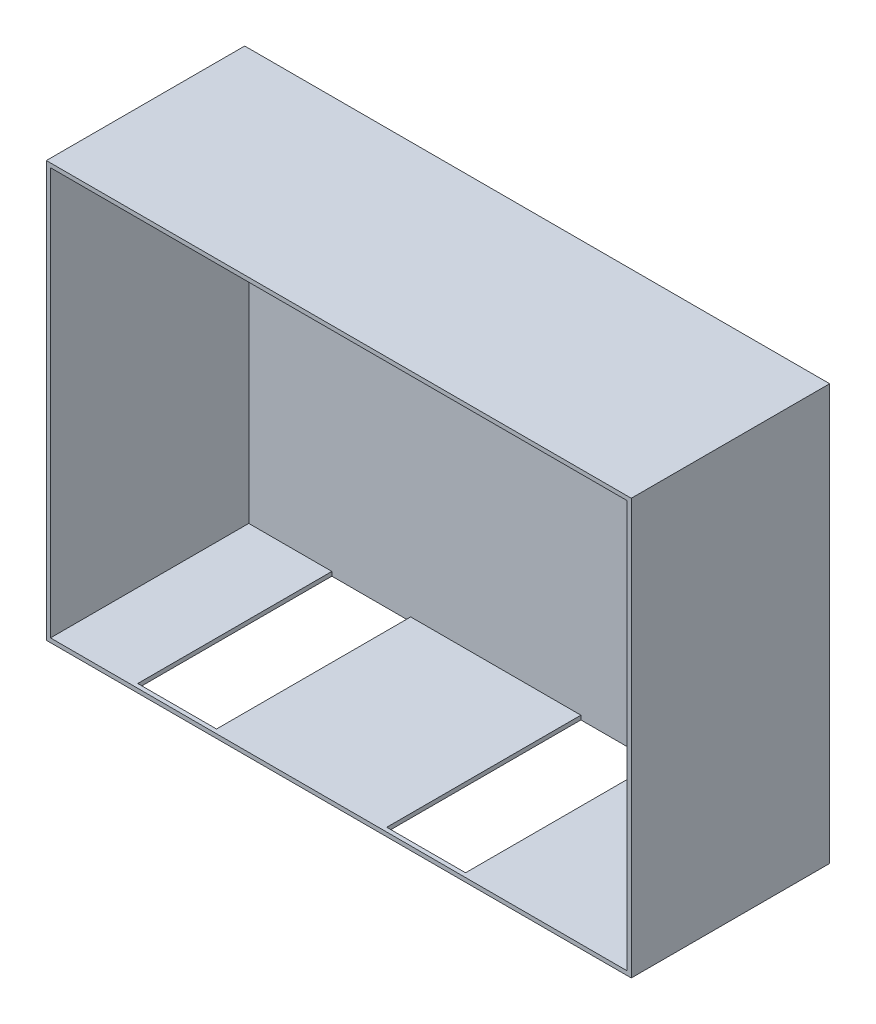
ISO-10303-21;
HEADER;
FILE_DESCRIPTION(('STEP AP214'),'2;1');
FILE_NAME('part.step','',(''),(''),'','','');
FILE_SCHEMA(('AUTOMOTIVE_DESIGN { 1 0 10303 214 1 1 1 1 }'));
ENDSEC;
DATA;
#1=APPLICATION_CONTEXT('core data for automotive mechanical design processes');
#2=APPLICATION_PROTOCOL_DEFINITION('international standard','automotive_design',2000,#1);
#3=PRODUCT_CONTEXT('',#1,'mechanical');
#4=PRODUCT('Part','Part','',(#3));
#5=PRODUCT_RELATED_PRODUCT_CATEGORY('part','',(#4));
#6=PRODUCT_DEFINITION_FORMATION('','',#4);
#7=PRODUCT_DEFINITION_CONTEXT('part definition',#1,'design');
#8=PRODUCT_DEFINITION('design','',#6,#7);
#9=PRODUCT_DEFINITION_SHAPE('','',#8);
#10=(LENGTH_UNIT() NAMED_UNIT(*) SI_UNIT(.MILLI.,.METRE.));
#11=(NAMED_UNIT(*) PLANE_ANGLE_UNIT() SI_UNIT($,.RADIAN.));
#12=(NAMED_UNIT(*) SI_UNIT($,.STERADIAN.) SOLID_ANGLE_UNIT());
#13=UNCERTAINTY_MEASURE_WITH_UNIT(LENGTH_MEASURE(1.E-05),#10,'distance_accuracy_value','');
#14=(GEOMETRIC_REPRESENTATION_CONTEXT(3) GLOBAL_UNCERTAINTY_ASSIGNED_CONTEXT((#13)) GLOBAL_UNIT_ASSIGNED_CONTEXT((#10,
#11,#12)) REPRESENTATION_CONTEXT('',''));
#15=CARTESIAN_POINT('',(0.,0.,0.));
#16=DIRECTION('',(0.,0.,1.));
#17=DIRECTION('',(1.,0.,0.));
#18=AXIS2_PLACEMENT_3D('',#15,#16,#17);
#19=CARTESIAN_POINT('',(0.,0.,2400.));
#20=DIRECTION('',(0.,0.,-1.));
#21=DIRECTION('',(-1.,0.,0.));
#22=AXIS2_PLACEMENT_3D('',#19,#20,#21);
#23=PLANE('',#22);
#24=DIRECTION('',(-1.,0.,0.));
#25=VECTOR('',#24,1.);
#26=CARTESIAN_POINT('',(-3540.,2514.5,2400.));
#27=LINE('',#26,#25);
#28=CARTESIAN_POINT('',(3540.,2514.5,2400.));
#29=VERTEX_POINT('',#28);
#30=CARTESIAN_POINT('',(-3540.,2514.5,2400.));
#31=VERTEX_POINT('',#30);
#32=EDGE_CURVE('E271',#29,#31,#27,.T.);
#33=ORIENTED_EDGE('',*,*,#32,.T.);
#34=DIRECTION('',(0.,-1.,0.));
#35=VECTOR('',#34,1.);
#36=CARTESIAN_POINT('',(-3540.,2514.5,2400.));
#37=LINE('',#36,#35);
#38=CARTESIAN_POINT('',(-3540.,-2514.5,2400.));
#39=VERTEX_POINT('',#38);
#40=EDGE_CURVE('E274',#31,#39,#37,.T.);
#41=ORIENTED_EDGE('',*,*,#40,.T.);
#42=DIRECTION('',(1.,0.,0.));
#43=VECTOR('',#42,1.);
#44=CARTESIAN_POINT('',(-3540.,-2514.5,2400.));
#45=LINE('',#44,#43);
#46=CARTESIAN_POINT('',(3540.,-2514.5,2400.));
#47=VERTEX_POINT('',#46);
#48=EDGE_CURVE('E276',#39,#47,#45,.T.);
#49=ORIENTED_EDGE('',*,*,#48,.T.);
#50=DIRECTION('',(0.,1.,0.));
#51=VECTOR('',#50,1.);
#52=CARTESIAN_POINT('',(3540.,2514.5,2400.));
#53=LINE('',#52,#51);
#54=EDGE_CURVE('E157',#47,#29,#53,.T.);
#55=ORIENTED_EDGE('',*,*,#54,.T.);
#56=EDGE_LOOP('',(#33,#41,#49,#55));
#57=FACE_BOUND('',#56,.T.);
#58=DIRECTION('',(0.,1.,0.));
#59=VECTOR('',#58,1.);
#60=CARTESIAN_POINT('',(3490.,2464.5,2400.));
#61=LINE('',#60,#59);
#62=CARTESIAN_POINT('',(3490.,-2464.5,2400.));
#63=VERTEX_POINT('',#62);
#64=CARTESIAN_POINT('',(3490.,2464.5,2400.));
#65=VERTEX_POINT('',#64);
#66=EDGE_CURVE('E239',#63,#65,#61,.T.);
#67=ORIENTED_EDGE('',*,*,#66,.F.);
#68=DIRECTION('',(1.,0.,0.));
#69=VECTOR('',#68,1.);
#70=CARTESIAN_POINT('',(-3490.,-2464.5,2400.));
#71=LINE('',#70,#69);
#72=CARTESIAN_POINT('',(-3490.,-2464.5,2400.));
#73=VERTEX_POINT('',#72);
#74=EDGE_CURVE('E247',#73,#63,#71,.T.);
#75=ORIENTED_EDGE('',*,*,#74,.F.);
#76=DIRECTION('',(0.,-1.,0.));
#77=VECTOR('',#76,1.);
#78=CARTESIAN_POINT('',(-3490.,2464.5,2400.));
#79=LINE('',#78,#77);
#80=CARTESIAN_POINT('',(-3490.,2464.5,2400.));
#81=VERTEX_POINT('',#80);
#82=EDGE_CURVE('E244',#81,#73,#79,.T.);
#83=ORIENTED_EDGE('',*,*,#82,.F.);
#84=DIRECTION('',(-1.,0.,0.));
#85=VECTOR('',#84,1.);
#86=CARTESIAN_POINT('',(-3490.,2464.5,2400.));
#87=LINE('',#86,#85);
#88=EDGE_CURVE('E241',#65,#81,#87,.T.);
#89=ORIENTED_EDGE('',*,*,#88,.F.);
#90=EDGE_LOOP('',(#67,#75,#83,#89));
#91=FACE_BOUND('',#90,.T.);
#92=ADVANCED_FACE('F37',(#57,#91),#23,.F.);
#93=CARTESIAN_POINT('',(-3540.,2514.5,2400.));
#94=DIRECTION('',(0.,-1.,0.));
#95=DIRECTION('',(0.,0.,-1.));
#96=AXIS2_PLACEMENT_3D('',#93,#94,#95);
#97=PLANE('',#96);
#98=DIRECTION('',(0.,0.,-1.));
#99=VECTOR('',#98,1.);
#100=CARTESIAN_POINT('',(3540.,2514.5,2400.));
#101=LINE('',#100,#99);
#102=CARTESIAN_POINT('',(3540.,2514.5,-1.));
#103=VERTEX_POINT('',#102);
#104=EDGE_CURVE('E160',#29,#103,#101,.T.);
#105=ORIENTED_EDGE('',*,*,#104,.T.);
#106=DIRECTION('',(1.,0.,0.));
#107=VECTOR('',#106,1.);
#108=CARTESIAN_POINT('',(3540.,2514.5,-1.));
#109=LINE('',#108,#107);
#110=CARTESIAN_POINT('',(-3540.,2514.5,-1.));
#111=VERTEX_POINT('',#110);
#112=EDGE_CURVE('E175',#111,#103,#109,.T.);
#113=ORIENTED_EDGE('',*,*,#112,.F.);
#114=DIRECTION('',(0.,0.,-1.));
#115=VECTOR('',#114,1.);
#116=CARTESIAN_POINT('',(-3540.,2514.5,2400.));
#117=LINE('',#116,#115);
#118=EDGE_CURVE('E11',#31,#111,#117,.T.);
#119=ORIENTED_EDGE('',*,*,#118,.F.);
#120=ORIENTED_EDGE('',*,*,#32,.F.);
#121=EDGE_LOOP('',(#105,#113,#119,#120));
#122=FACE_BOUND('',#121,.T.);
#123=ADVANCED_FACE('F39',(#122),#97,.F.);
#124=CARTESIAN_POINT('',(-3540.,2514.5,2400.));
#125=DIRECTION('',(1.,0.,0.));
#126=DIRECTION('',(0.,1.,0.));
#127=AXIS2_PLACEMENT_3D('',#124,#125,#126);
#128=PLANE('',#127);
#129=ORIENTED_EDGE('',*,*,#118,.T.);
#130=DIRECTION('',(0.,1.,0.));
#131=VECTOR('',#130,1.);
#132=CARTESIAN_POINT('',(-3540.,2514.5,-1.));
#133=LINE('',#132,#131);
#134=CARTESIAN_POINT('',(-3540.,-2514.5,-1.));
#135=VERTEX_POINT('',#134);
#136=EDGE_CURVE('E170',#135,#111,#133,.T.);
#137=ORIENTED_EDGE('',*,*,#136,.F.);
#138=DIRECTION('',(0.,0.,-1.));
#139=VECTOR('',#138,1.);
#140=CARTESIAN_POINT('',(-3540.,-2514.5,2400.));
#141=LINE('',#140,#139);
#142=EDGE_CURVE('E45',#39,#135,#141,.T.);
#143=ORIENTED_EDGE('',*,*,#142,.F.);
#144=ORIENTED_EDGE('',*,*,#40,.F.);
#145=EDGE_LOOP('',(#129,#137,#143,#144));
#146=FACE_BOUND('',#145,.T.);
#147=ADVANCED_FACE('F285',(#146),#128,.F.);
#148=CARTESIAN_POINT('',(-3540.,-2514.5,2400.));
#149=DIRECTION('',(0.,1.,0.));
#150=DIRECTION('',(-1.,0.,0.));
#151=AXIS2_PLACEMENT_3D('',#148,#149,#150);
#152=PLANE('',#151);
#153=DIRECTION('',(-1.,0.,0.));
#154=VECTOR('',#153,1.);
#155=CARTESIAN_POINT('',(3540.,-2514.5,-1.));
#156=LINE('',#155,#154);
#157=CARTESIAN_POINT('',(3540.,-2514.5,-1.));
#158=VERTEX_POINT('',#157);
#159=EDGE_CURVE('E163',#158,#135,#156,.T.);
#160=ORIENTED_EDGE('',*,*,#159,.F.);
#161=DIRECTION('',(0.,0.,-1.));
#162=VECTOR('',#161,1.);
#163=CARTESIAN_POINT('',(3540.,-2514.5,2400.));
#164=LINE('',#163,#162);
#165=EDGE_CURVE('E151',#47,#158,#164,.T.);
#166=ORIENTED_EDGE('',*,*,#165,.F.);
#167=ORIENTED_EDGE('',*,*,#48,.F.);
#168=ORIENTED_EDGE('',*,*,#142,.T.);
#169=EDGE_LOOP('',(#160,#166,#167,#168));
#170=FACE_BOUND('',#169,.T.);
#171=DIRECTION('',(-1.,0.,0.));
#172=VECTOR('',#171,1.);
#173=CARTESIAN_POINT('',(3540.,-2514.5,0.));
#174=LINE('',#173,#172);
#175=CARTESIAN_POINT('',(1484.,-2514.5,0.));
#176=VERTEX_POINT('',#175);
#177=CARTESIAN_POINT('',(530.000000000001,-2514.5,0.));
#178=VERTEX_POINT('',#177);
#179=EDGE_CURVE('E176',#176,#178,#174,.T.);
#180=ORIENTED_EDGE('',*,*,#179,.T.);
#181=DIRECTION('',(0.,0.,-1.));
#182=VECTOR('',#181,1.);
#183=CARTESIAN_POINT('',(530.000000000001,-2514.5,2350.));
#184=LINE('',#183,#182);
#185=CARTESIAN_POINT('',(530.000000000001,-2514.5,2350.));
#186=VERTEX_POINT('',#185);
#187=EDGE_CURVE('E221',#186,#178,#184,.T.);
#188=ORIENTED_EDGE('',*,*,#187,.F.);
#189=DIRECTION('',(-1.,0.,0.));
#190=VECTOR('',#189,1.);
#191=CARTESIAN_POINT('',(530.000000000001,-2514.5,2350.));
#192=LINE('',#191,#190);
#193=CARTESIAN_POINT('',(1484.,-2514.5,2350.));
#194=VERTEX_POINT('',#193);
#195=EDGE_CURVE('E229',#194,#186,#192,.T.);
#196=ORIENTED_EDGE('',*,*,#195,.F.);
#197=DIRECTION('',(0.,0.,1.));
#198=VECTOR('',#197,1.);
#199=CARTESIAN_POINT('',(1484.,-2514.5,2350.));
#200=LINE('',#199,#198);
#201=EDGE_CURVE('E232',#176,#194,#200,.T.);
#202=ORIENTED_EDGE('',*,*,#201,.F.);
#203=EDGE_LOOP('',(#180,#188,#196,#202));
#204=FACE_BOUND('',#203,.T.);
#205=DIRECTION('',(0.,0.,1.));
#206=VECTOR('',#205,1.);
#207=CARTESIAN_POINT('',(-1530.,-2514.5,2350.));
#208=LINE('',#207,#206);
#209=CARTESIAN_POINT('',(-1530.,-2514.5,0.));
#210=VERTEX_POINT('',#209);
#211=CARTESIAN_POINT('',(-1530.,-2514.5,2350.));
#212=VERTEX_POINT('',#211);
#213=EDGE_CURVE('E197',#210,#212,#208,.T.);
#214=ORIENTED_EDGE('',*,*,#213,.F.);
#215=CARTESIAN_POINT('',(-2484.,-2514.5,0.));
#216=VERTEX_POINT('',#215);
#217=EDGE_CURVE('E179',#210,#216,#174,.T.);
#218=ORIENTED_EDGE('',*,*,#217,.T.);
#219=DIRECTION('',(0.,0.,-1.));
#220=VECTOR('',#219,1.);
#221=CARTESIAN_POINT('',(-2484.,-2514.5,2350.));
#222=LINE('',#221,#220);
#223=CARTESIAN_POINT('',(-2484.,-2514.5,2350.));
#224=VERTEX_POINT('',#223);
#225=EDGE_CURVE('E202',#224,#216,#222,.T.);
#226=ORIENTED_EDGE('',*,*,#225,.F.);
#227=DIRECTION('',(-1.,0.,0.));
#228=VECTOR('',#227,1.);
#229=CARTESIAN_POINT('',(-2484.,-2514.5,2350.));
#230=LINE('',#229,#228);
#231=EDGE_CURVE('E199',#212,#224,#230,.T.);
#232=ORIENTED_EDGE('',*,*,#231,.F.);
#233=EDGE_LOOP('',(#214,#218,#226,#232));
#234=FACE_BOUND('',#233,.T.);
#235=ADVANCED_FACE('F164',(#170,#204,#234),#152,.F.);
#236=CARTESIAN_POINT('',(3540.,2514.5,2400.));
#237=DIRECTION('',(-1.,0.,0.));
#238=DIRECTION('',(0.,0.,1.));
#239=AXIS2_PLACEMENT_3D('',#236,#237,#238);
#240=PLANE('',#239);
#241=ORIENTED_EDGE('',*,*,#165,.T.);
#242=DIRECTION('',(0.,-1.,0.));
#243=VECTOR('',#242,1.);
#244=CARTESIAN_POINT('',(3540.,2514.5,-1.));
#245=LINE('',#244,#243);
#246=EDGE_CURVE('E156',#103,#158,#245,.T.);
#247=ORIENTED_EDGE('',*,*,#246,.F.);
#248=ORIENTED_EDGE('',*,*,#104,.F.);
#249=ORIENTED_EDGE('',*,*,#54,.F.);
#250=EDGE_LOOP('',(#241,#247,#248,#249));
#251=FACE_BOUND('',#250,.T.);
#252=ADVANCED_FACE('F153',(#251),#240,.F.);
#253=CARTESIAN_POINT('',(3490.,2464.5,2400.));
#254=DIRECTION('',(-1.,0.,0.));
#255=DIRECTION('',(0.,-1.,0.));
#256=AXIS2_PLACEMENT_3D('',#253,#254,#255);
#257=PLANE('',#256);
#258=DIRECTION('',(0.,1.,0.));
#259=VECTOR('',#258,1.);
#260=CARTESIAN_POINT('',(3490.,2464.5,0.));
#261=LINE('',#260,#259);
#262=CARTESIAN_POINT('',(3490.,-2464.5,0.));
#263=VERTEX_POINT('',#262);
#264=CARTESIAN_POINT('',(3490.,2464.5,0.));
#265=VERTEX_POINT('',#264);
#266=EDGE_CURVE('E216',#263,#265,#261,.T.);
#267=ORIENTED_EDGE('',*,*,#266,.F.);
#268=DIRECTION('',(0.,0.,-1.));
#269=VECTOR('',#268,1.);
#270=CARTESIAN_POINT('',(3490.,-2464.5,2400.));
#271=LINE('',#270,#269);
#272=EDGE_CURVE('E249',#63,#263,#271,.T.);
#273=ORIENTED_EDGE('',*,*,#272,.F.);
#274=ORIENTED_EDGE('',*,*,#66,.T.);
#275=DIRECTION('',(0.,0.,-1.));
#276=VECTOR('',#275,1.);
#277=CARTESIAN_POINT('',(3490.,2464.5,2400.));
#278=LINE('',#277,#276);
#279=EDGE_CURVE('E268',#65,#265,#278,.T.);
#280=ORIENTED_EDGE('',*,*,#279,.T.);
#281=EDGE_LOOP('',(#267,#273,#274,#280));
#282=FACE_BOUND('',#281,.T.);
#283=ADVANCED_FACE('F298',(#282),#257,.T.);
#284=CARTESIAN_POINT('',(-3490.,2464.5,2400.));
#285=DIRECTION('',(0.,-1.,0.));
#286=DIRECTION('',(0.,0.,-1.));
#287=AXIS2_PLACEMENT_3D('',#284,#285,#286);
#288=PLANE('',#287);
#289=DIRECTION('',(-1.,0.,0.));
#290=VECTOR('',#289,1.);
#291=CARTESIAN_POINT('',(-3490.,2464.5,0.));
#292=LINE('',#291,#290);
#293=CARTESIAN_POINT('',(-3490.,2464.5,0.));
#294=VERTEX_POINT('',#293);
#295=EDGE_CURVE('E252',#265,#294,#292,.T.);
#296=ORIENTED_EDGE('',*,*,#295,.F.);
#297=ORIENTED_EDGE('',*,*,#279,.F.);
#298=ORIENTED_EDGE('',*,*,#88,.T.);
#299=DIRECTION('',(0.,0.,-1.));
#300=VECTOR('',#299,1.);
#301=CARTESIAN_POINT('',(-3490.,2464.5,2400.));
#302=LINE('',#301,#300);
#303=EDGE_CURVE('E266',#81,#294,#302,.T.);
#304=ORIENTED_EDGE('',*,*,#303,.T.);
#305=EDGE_LOOP('',(#296,#297,#298,#304));
#306=FACE_BOUND('',#305,.T.);
#307=ADVANCED_FACE('F304',(#306),#288,.T.);
#308=CARTESIAN_POINT('',(-3490.,2464.5,2400.));
#309=DIRECTION('',(1.,0.,0.));
#310=DIRECTION('',(0.,1.,0.));
#311=AXIS2_PLACEMENT_3D('',#308,#309,#310);
#312=PLANE('',#311);
#313=DIRECTION('',(0.,-1.,0.));
#314=VECTOR('',#313,1.);
#315=CARTESIAN_POINT('',(-3490.,2464.5,0.));
#316=LINE('',#315,#314);
#317=CARTESIAN_POINT('',(-3490.,-2464.5,0.));
#318=VERTEX_POINT('',#317);
#319=EDGE_CURVE('E255',#294,#318,#316,.T.);
#320=ORIENTED_EDGE('',*,*,#319,.F.);
#321=ORIENTED_EDGE('',*,*,#303,.F.);
#322=ORIENTED_EDGE('',*,*,#82,.T.);
#323=DIRECTION('',(0.,0.,-1.));
#324=VECTOR('',#323,1.);
#325=CARTESIAN_POINT('',(-3490.,-2464.5,2400.));
#326=LINE('',#325,#324);
#327=EDGE_CURVE('E264',#73,#318,#326,.T.);
#328=ORIENTED_EDGE('',*,*,#327,.T.);
#329=EDGE_LOOP('',(#320,#321,#322,#328));
#330=FACE_BOUND('',#329,.T.);
#331=ADVANCED_FACE('F309',(#330),#312,.T.);
#332=CARTESIAN_POINT('',(-3490.,-2464.5,2400.));
#333=DIRECTION('',(0.,1.,0.));
#334=DIRECTION('',(0.,0.,1.));
#335=AXIS2_PLACEMENT_3D('',#332,#333,#334);
#336=PLANE('',#335);
#337=DIRECTION('',(0.,0.,-1.));
#338=VECTOR('',#337,1.);
#339=CARTESIAN_POINT('',(-2484.,-2464.5,2350.));
#340=LINE('',#339,#338);
#341=CARTESIAN_POINT('',(-2484.,-2464.5,2350.));
#342=VERTEX_POINT('',#341);
#343=CARTESIAN_POINT('',(-2484.,-2464.5,0.));
#344=VERTEX_POINT('',#343);
#345=EDGE_CURVE('E190',#342,#344,#340,.T.);
#346=ORIENTED_EDGE('',*,*,#345,.T.);
#347=DIRECTION('',(1.,0.,0.));
#348=VECTOR('',#347,1.);
#349=CARTESIAN_POINT('',(-3490.,-2464.5,0.));
#350=LINE('',#349,#348);
#351=EDGE_CURVE('E242',#318,#344,#350,.T.);
#352=ORIENTED_EDGE('',*,*,#351,.F.);
#353=ORIENTED_EDGE('',*,*,#327,.F.);
#354=ORIENTED_EDGE('',*,*,#74,.T.);
#355=ORIENTED_EDGE('',*,*,#272,.T.);
#356=CARTESIAN_POINT('',(1484.,-2464.5,0.));
#357=VERTEX_POINT('',#356);
#358=EDGE_CURVE('E258',#357,#263,#350,.T.);
#359=ORIENTED_EDGE('',*,*,#358,.F.);
#360=DIRECTION('',(0.,0.,1.));
#361=VECTOR('',#360,1.);
#362=CARTESIAN_POINT('',(1484.,-2464.5,2350.));
#363=LINE('',#362,#361);
#364=CARTESIAN_POINT('',(1484.,-2464.5,2350.));
#365=VERTEX_POINT('',#364);
#366=EDGE_CURVE('E234',#357,#365,#363,.T.);
#367=ORIENTED_EDGE('',*,*,#366,.T.);
#368=DIRECTION('',(-1.,0.,0.));
#369=VECTOR('',#368,1.);
#370=CARTESIAN_POINT('',(530.000000000001,-2464.5,2350.));
#371=LINE('',#370,#369);
#372=CARTESIAN_POINT('',(530.000000000001,-2464.5,2350.));
#373=VERTEX_POINT('',#372);
#374=EDGE_CURVE('E186',#365,#373,#371,.T.);
#375=ORIENTED_EDGE('',*,*,#374,.T.);
#376=DIRECTION('',(0.,0.,-1.));
#377=VECTOR('',#376,1.);
#378=CARTESIAN_POINT('',(530.000000000001,-2464.5,2350.));
#379=LINE('',#378,#377);
#380=CARTESIAN_POINT('',(530.,-2464.5,0.));
#381=VERTEX_POINT('',#380);
#382=EDGE_CURVE('E194',#373,#381,#379,.T.);
#383=ORIENTED_EDGE('',*,*,#382,.T.);
#384=CARTESIAN_POINT('',(-1530.,-2464.5,0.));
#385=VERTEX_POINT('',#384);
#386=EDGE_CURVE('E261',#385,#381,#350,.T.);
#387=ORIENTED_EDGE('',*,*,#386,.F.);
#388=DIRECTION('',(0.,0.,1.));
#389=VECTOR('',#388,1.);
#390=CARTESIAN_POINT('',(-1530.,-2464.5,2350.));
#391=LINE('',#390,#389);
#392=CARTESIAN_POINT('',(-1530.,-2464.5,2350.));
#393=VERTEX_POINT('',#392);
#394=EDGE_CURVE('E193',#385,#393,#391,.T.);
#395=ORIENTED_EDGE('',*,*,#394,.T.);
#396=DIRECTION('',(-1.,0.,0.));
#397=VECTOR('',#396,1.);
#398=CARTESIAN_POINT('',(-2484.,-2464.5,2350.));
#399=LINE('',#398,#397);
#400=EDGE_CURVE('E207',#393,#342,#399,.T.);
#401=ORIENTED_EDGE('',*,*,#400,.T.);
#402=EDGE_LOOP('',(#346,#352,#353,#354,#355,#359,#367,#375,#383,#387,#395,#401));
#403=FACE_BOUND('',#402,.T.);
#404=ADVANCED_FACE('F318',(#403),#336,.T.);
#405=CARTESIAN_POINT('',(530.000000000001,2514.501,2350.));
#406=DIRECTION('',(0.,0.,1.));
#407=DIRECTION('',(1.,0.,0.));
#408=AXIS2_PLACEMENT_3D('',#405,#406,#407);
#409=PLANE('',#408);
#410=DIRECTION('',(0.,-1.,0.));
#411=VECTOR('',#410,1.);
#412=CARTESIAN_POINT('',(1484.,2514.501,2350.));
#413=LINE('',#412,#411);
#414=EDGE_CURVE('E60',#365,#194,#413,.T.);
#415=ORIENTED_EDGE('',*,*,#414,.T.);
#416=ORIENTED_EDGE('',*,*,#195,.T.);
#417=DIRECTION('',(0.,-1.,0.));
#418=VECTOR('',#417,1.);
#419=CARTESIAN_POINT('',(530.000000000001,2514.501,2350.));
#420=LINE('',#419,#418);
#421=EDGE_CURVE('E222',#373,#186,#420,.T.);
#422=ORIENTED_EDGE('',*,*,#421,.F.);
#423=ORIENTED_EDGE('',*,*,#374,.F.);
#424=EDGE_LOOP('',(#415,#416,#422,#423));
#425=FACE_BOUND('',#424,.T.);
#426=ADVANCED_FACE('F330',(#425),#409,.F.);
#427=CARTESIAN_POINT('',(530.000000000001,2514.501,2350.));
#428=DIRECTION('',(-1.,0.,0.));
#429=DIRECTION('',(0.,0.,1.));
#430=AXIS2_PLACEMENT_3D('',#427,#428,#429);
#431=PLANE('',#430);
#432=ORIENTED_EDGE('',*,*,#421,.T.);
#433=ORIENTED_EDGE('',*,*,#187,.T.);
#434=DIRECTION('',(0.,-1.,0.));
#435=VECTOR('',#434,1.);
#436=CARTESIAN_POINT('',(530.000000000001,2514.501,0.));
#437=LINE('',#436,#435);
#438=EDGE_CURVE('E224',#381,#178,#437,.T.);
#439=ORIENTED_EDGE('',*,*,#438,.F.);
#440=ORIENTED_EDGE('',*,*,#382,.F.);
#441=EDGE_LOOP('',(#432,#433,#439,#440));
#442=FACE_BOUND('',#441,.T.);
#443=ADVANCED_FACE('F326',(#442),#431,.F.);
#444=CARTESIAN_POINT('',(1484.,2514.501,2350.));
#445=DIRECTION('',(1.,0.,0.));
#446=DIRECTION('',(0.,0.,-1.));
#447=AXIS2_PLACEMENT_3D('',#444,#445,#446);
#448=PLANE('',#447);
#449=DIRECTION('',(0.,-1.,0.));
#450=VECTOR('',#449,1.);
#451=CARTESIAN_POINT('',(1484.,2514.501,0.));
#452=LINE('',#451,#450);
#453=EDGE_CURVE('E219',#357,#176,#452,.T.);
#454=ORIENTED_EDGE('',*,*,#453,.T.);
#455=ORIENTED_EDGE('',*,*,#201,.T.);
#456=ORIENTED_EDGE('',*,*,#414,.F.);
#457=ORIENTED_EDGE('',*,*,#366,.F.);
#458=EDGE_LOOP('',(#454,#455,#456,#457));
#459=FACE_BOUND('',#458,.T.);
#460=ADVANCED_FACE('F334',(#459),#448,.F.);
#461=CARTESIAN_POINT('',(-2484.,2514.501,2350.));
#462=DIRECTION('',(0.,0.,1.));
#463=DIRECTION('',(1.,0.,0.));
#464=AXIS2_PLACEMENT_3D('',#461,#462,#463);
#465=PLANE('',#464);
#466=DIRECTION('',(0.,-1.,0.));
#467=VECTOR('',#466,1.);
#468=CARTESIAN_POINT('',(-1530.,2514.501,2350.));
#469=LINE('',#468,#467);
#470=EDGE_CURVE('E52',#393,#212,#469,.T.);
#471=ORIENTED_EDGE('',*,*,#470,.T.);
#472=ORIENTED_EDGE('',*,*,#231,.T.);
#473=DIRECTION('',(0.,-1.,0.));
#474=VECTOR('',#473,1.);
#475=CARTESIAN_POINT('',(-2484.,2514.501,2350.));
#476=LINE('',#475,#474);
#477=EDGE_CURVE('E211',#342,#224,#476,.T.);
#478=ORIENTED_EDGE('',*,*,#477,.F.);
#479=ORIENTED_EDGE('',*,*,#400,.F.);
#480=EDGE_LOOP('',(#471,#472,#478,#479));
#481=FACE_BOUND('',#480,.T.);
#482=ADVANCED_FACE('F336',(#481),#465,.F.);
#483=CARTESIAN_POINT('',(-2484.,2514.501,2350.));
#484=DIRECTION('',(-1.,0.,0.));
#485=DIRECTION('',(0.,0.,1.));
#486=AXIS2_PLACEMENT_3D('',#483,#484,#485);
#487=PLANE('',#486);
#488=ORIENTED_EDGE('',*,*,#477,.T.);
#489=ORIENTED_EDGE('',*,*,#225,.T.);
#490=DIRECTION('',(0.,-1.,0.));
#491=VECTOR('',#490,1.);
#492=CARTESIAN_POINT('',(-2484.,2514.501,0.));
#493=LINE('',#492,#491);
#494=EDGE_CURVE('E208',#344,#216,#493,.T.);
#495=ORIENTED_EDGE('',*,*,#494,.F.);
#496=ORIENTED_EDGE('',*,*,#345,.F.);
#497=EDGE_LOOP('',(#488,#489,#495,#496));
#498=FACE_BOUND('',#497,.T.);
#499=ADVANCED_FACE('F342',(#498),#487,.F.);
#500=CARTESIAN_POINT('',(-1530.,2514.501,2350.));
#501=DIRECTION('',(1.,0.,0.));
#502=DIRECTION('',(0.,0.,-1.));
#503=AXIS2_PLACEMENT_3D('',#500,#501,#502);
#504=PLANE('',#503);
#505=DIRECTION('',(0.,-1.,0.));
#506=VECTOR('',#505,1.);
#507=CARTESIAN_POINT('',(-1530.,2514.501,0.));
#508=LINE('',#507,#506);
#509=EDGE_CURVE('E204',#385,#210,#508,.T.);
#510=ORIENTED_EDGE('',*,*,#509,.T.);
#511=ORIENTED_EDGE('',*,*,#213,.T.);
#512=ORIENTED_EDGE('',*,*,#470,.F.);
#513=ORIENTED_EDGE('',*,*,#394,.F.);
#514=EDGE_LOOP('',(#510,#511,#512,#513));
#515=FACE_BOUND('',#514,.T.);
#516=ADVANCED_FACE('F348',(#515),#504,.F.);
#517=CARTESIAN_POINT('',(0.,0.,0.));
#518=DIRECTION('',(0.,0.,-1.));
#519=DIRECTION('',(-1.,0.,0.));
#520=AXIS2_PLACEMENT_3D('',#517,#518,#519);
#521=PLANE('',#520);
#522=CARTESIAN_POINT('',(-1986.,489.5,0.));
#523=DIRECTION('',(0.,0.,1.));
#524=DIRECTION('',(1.,0.,0.));
#525=AXIS2_PLACEMENT_3D('',#522,#523,#524);
#526=CIRCLE('',#525,9.99999999999963);
#527=CARTESIAN_POINT('',(-1976.,489.5,0.));
#528=VERTEX_POINT('',#527);
#529=EDGE_CURVE('E189',#528,#528,#526,.T.);
#530=ORIENTED_EDGE('',*,*,#529,.F.);
#531=EDGE_LOOP('',(#530));
#532=FACE_BOUND('',#531,.T.);
#533=ORIENTED_EDGE('',*,*,#179,.F.);
#534=ORIENTED_EDGE('',*,*,#453,.F.);
#535=ORIENTED_EDGE('',*,*,#358,.T.);
#536=ORIENTED_EDGE('',*,*,#266,.T.);
#537=ORIENTED_EDGE('',*,*,#295,.T.);
#538=ORIENTED_EDGE('',*,*,#319,.T.);
#539=ORIENTED_EDGE('',*,*,#351,.T.);
#540=ORIENTED_EDGE('',*,*,#494,.T.);
#541=ORIENTED_EDGE('',*,*,#217,.F.);
#542=ORIENTED_EDGE('',*,*,#509,.F.);
#543=ORIENTED_EDGE('',*,*,#386,.T.);
#544=ORIENTED_EDGE('',*,*,#438,.T.);
#545=EDGE_LOOP('',(#533,#534,#535,#536,#537,#538,#539,#540,#541,#542,#543,#544));
#546=FACE_BOUND('',#545,.T.);
#547=ADVANCED_FACE('F322',(#532,#546),#521,.F.);
#548=CARTESIAN_POINT('',(0.,0.,-1.));
#549=DIRECTION('',(0.,0.,-1.));
#550=DIRECTION('',(-1.,0.,0.));
#551=AXIS2_PLACEMENT_3D('',#548,#549,#550);
#552=PLANE('',#551);
#553=CARTESIAN_POINT('',(-1986.,489.5,-1.));
#554=DIRECTION('',(0.,0.,-1.));
#555=DIRECTION('',(-1.,0.,0.));
#556=AXIS2_PLACEMENT_3D('',#553,#554,#555);
#557=CIRCLE('',#556,9.99999999999963);
#558=CARTESIAN_POINT('',(-1996.,489.5,-1.));
#559=VERTEX_POINT('',#558);
#560=EDGE_CURVE('E182',#559,#559,#557,.F.);
#561=ORIENTED_EDGE('',*,*,#560,.T.);
#562=EDGE_LOOP('',(#561));
#563=FACE_BOUND('',#562,.T.);
#564=ORIENTED_EDGE('',*,*,#246,.T.);
#565=ORIENTED_EDGE('',*,*,#159,.T.);
#566=ORIENTED_EDGE('',*,*,#136,.T.);
#567=ORIENTED_EDGE('',*,*,#112,.T.);
#568=EDGE_LOOP('',(#564,#565,#566,#567));
#569=FACE_BOUND('',#568,.T.);
#570=ADVANCED_FACE('F173',(#563,#569),#552,.T.);
#571=CARTESIAN_POINT('',(-1986.,489.5,-1.001));
#572=DIRECTION('',(0.,0.,1.));
#573=DIRECTION('',(1.,0.,0.));
#574=AXIS2_PLACEMENT_3D('',#571,#572,#573);
#575=CYLINDRICAL_SURFACE('',#574,9.99999999999963);
#576=ORIENTED_EDGE('',*,*,#560,.F.);
#577=EDGE_LOOP('',(#576));
#578=FACE_BOUND('',#577,.T.);
#579=ORIENTED_EDGE('',*,*,#529,.T.);
#580=EDGE_LOOP('',(#579));
#581=FACE_BOUND('',#580,.T.);
#582=ADVANCED_FACE('F380',(#578,#581),#575,.F.);
#583=CLOSED_SHELL('',(#92,#123,#147,#235,#252,#283,#307,#331,#404,#426,#443,#460,#482,#499,#516,
#547,#570,#582));
#584=MANIFOLD_SOLID_BREP('B2',#583);
#585=ADVANCED_BREP_SHAPE_REPRESENTATION('',(#18,#584),#14);
#586=SHAPE_DEFINITION_REPRESENTATION(#9,#585);
ENDSEC;
END-ISO-10303-21;
